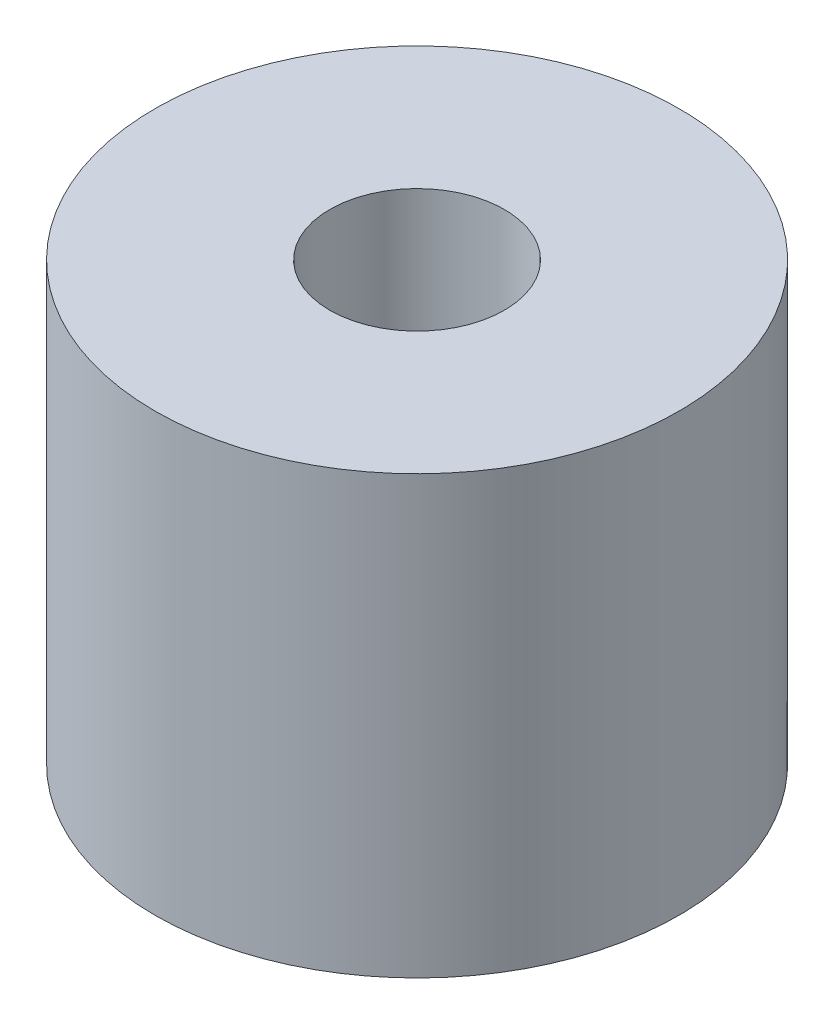
ISO-10303-21;
HEADER;
FILE_DESCRIPTION(('STEP AP214'),'2;1');
FILE_NAME('part.step','',(''),(''),'','','');
FILE_SCHEMA(('AUTOMOTIVE_DESIGN { 1 0 10303 214 1 1 1 1 }'));
ENDSEC;
DATA;
#1=APPLICATION_CONTEXT('core data for automotive mechanical design processes');
#2=APPLICATION_PROTOCOL_DEFINITION('international standard','automotive_design',2000,#1);
#3=PRODUCT_CONTEXT('',#1,'mechanical');
#4=PRODUCT('Part','Part','',(#3));
#5=PRODUCT_RELATED_PRODUCT_CATEGORY('part','',(#4));
#6=PRODUCT_DEFINITION_FORMATION('','',#4);
#7=PRODUCT_DEFINITION_CONTEXT('part definition',#1,'design');
#8=PRODUCT_DEFINITION('design','',#6,#7);
#9=PRODUCT_DEFINITION_SHAPE('','',#8);
#10=(LENGTH_UNIT() NAMED_UNIT(*) SI_UNIT(.MILLI.,.METRE.));
#11=(NAMED_UNIT(*) PLANE_ANGLE_UNIT() SI_UNIT($,.RADIAN.));
#12=(NAMED_UNIT(*) SI_UNIT($,.STERADIAN.) SOLID_ANGLE_UNIT());
#13=UNCERTAINTY_MEASURE_WITH_UNIT(LENGTH_MEASURE(1.E-05),#10,'distance_accuracy_value','');
#14=(GEOMETRIC_REPRESENTATION_CONTEXT(3) GLOBAL_UNCERTAINTY_ASSIGNED_CONTEXT((#13)) GLOBAL_UNIT_ASSIGNED_CONTEXT((#10,
#11,#12)) REPRESENTATION_CONTEXT('',''));
#15=CARTESIAN_POINT('',(0.,0.,0.));
#16=DIRECTION('',(0.,0.,1.));
#17=DIRECTION('',(1.,0.,0.));
#18=AXIS2_PLACEMENT_3D('',#15,#16,#17);
#19=CARTESIAN_POINT('',(0.,10.,0.));
#20=DIRECTION('',(0.,1.,0.));
#21=DIRECTION('',(0.,0.,1.));
#22=AXIS2_PLACEMENT_3D('',#19,#20,#21);
#23=PLANE('',#22);
#24=CARTESIAN_POINT('',(0.,10.,0.));
#25=DIRECTION('',(0.,1.,0.));
#26=DIRECTION('',(0.,0.,1.));
#27=AXIS2_PLACEMENT_3D('',#24,#25,#26);
#28=CIRCLE('',#27,6.);
#29=CARTESIAN_POINT('',(0.,10.,6.));
#30=VERTEX_POINT('',#29);
#31=EDGE_CURVE('E10',#30,#30,#28,.T.);
#32=ORIENTED_EDGE('',*,*,#31,.T.);
#33=EDGE_LOOP('',(#32));
#34=FACE_BOUND('',#33,.T.);
#35=CARTESIAN_POINT('',(0.,10.,0.));
#36=DIRECTION('',(0.,1.,0.));
#37=DIRECTION('',(0.,0.,1.));
#38=AXIS2_PLACEMENT_3D('',#35,#36,#37);
#39=CIRCLE('',#38,2.);
#40=CARTESIAN_POINT('',(0.,10.,2.));
#41=VERTEX_POINT('',#40);
#42=EDGE_CURVE('E52',#41,#41,#39,.T.);
#43=ORIENTED_EDGE('',*,*,#42,.F.);
#44=EDGE_LOOP('',(#43));
#45=FACE_BOUND('',#44,.T.);
#46=ADVANCED_FACE('F41',(#34,#45),#23,.T.);
#47=CARTESIAN_POINT('',(0.,0.,0.));
#48=DIRECTION('',(0.,1.,0.));
#49=DIRECTION('',(0.,0.,1.));
#50=AXIS2_PLACEMENT_3D('',#47,#48,#49);
#51=PLANE('',#50);
#52=CARTESIAN_POINT('',(0.,0.,0.));
#53=DIRECTION('',(0.,1.,0.));
#54=DIRECTION('',(0.,0.,1.));
#55=AXIS2_PLACEMENT_3D('',#52,#53,#54);
#56=CIRCLE('',#55,6.);
#57=CARTESIAN_POINT('',(0.,0.,6.));
#58=VERTEX_POINT('',#57);
#59=EDGE_CURVE('E45',#58,#58,#56,.T.);
#60=ORIENTED_EDGE('',*,*,#59,.F.);
#61=EDGE_LOOP('',(#60));
#62=FACE_BOUND('',#61,.T.);
#63=CARTESIAN_POINT('',(0.,0.,0.));
#64=DIRECTION('',(0.,1.,0.));
#65=DIRECTION('',(0.,0.,1.));
#66=AXIS2_PLACEMENT_3D('',#63,#64,#65);
#67=CIRCLE('',#66,2.);
#68=CARTESIAN_POINT('',(0.,0.,2.));
#69=VERTEX_POINT('',#68);
#70=EDGE_CURVE('E54',#69,#69,#67,.T.);
#71=ORIENTED_EDGE('',*,*,#70,.T.);
#72=EDGE_LOOP('',(#71));
#73=FACE_BOUND('',#72,.T.);
#74=ADVANCED_FACE('F64',(#62,#73),#51,.F.);
#75=CARTESIAN_POINT('',(0.,10.,0.));
#76=DIRECTION('',(0.,-1.,0.));
#77=DIRECTION('',(0.,0.,-1.));
#78=AXIS2_PLACEMENT_3D('',#75,#76,#77);
#79=CYLINDRICAL_SURFACE('',#78,6.);
#80=ORIENTED_EDGE('',*,*,#31,.F.);
#81=EDGE_LOOP('',(#80));
#82=FACE_BOUND('',#81,.T.);
#83=ORIENTED_EDGE('',*,*,#59,.T.);
#84=EDGE_LOOP('',(#83));
#85=FACE_BOUND('',#84,.T.);
#86=ADVANCED_FACE('F43',(#82,#85),#79,.T.);
#87=CARTESIAN_POINT('',(0.,10.,0.));
#88=DIRECTION('',(0.,-1.,0.));
#89=DIRECTION('',(0.,0.,-1.));
#90=AXIS2_PLACEMENT_3D('',#87,#88,#89);
#91=CYLINDRICAL_SURFACE('',#90,2.);
#92=ORIENTED_EDGE('',*,*,#42,.T.);
#93=EDGE_LOOP('',(#92));
#94=FACE_BOUND('',#93,.T.);
#95=ORIENTED_EDGE('',*,*,#70,.F.);
#96=EDGE_LOOP('',(#95));
#97=FACE_BOUND('',#96,.T.);
#98=ADVANCED_FACE('F60',(#94,#97),#91,.F.);
#99=CLOSED_SHELL('',(#46,#74,#86,#98));
#100=MANIFOLD_SOLID_BREP('B2',#99);
#101=ADVANCED_BREP_SHAPE_REPRESENTATION('',(#18,#100),#14);
#102=SHAPE_DEFINITION_REPRESENTATION(#9,#101);
ENDSEC;
END-ISO-10303-21;
